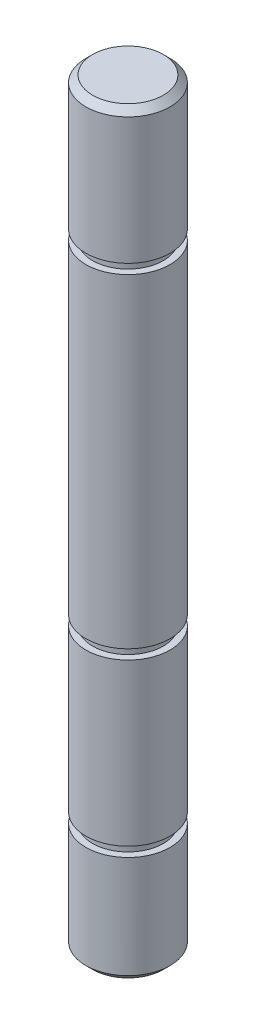
ISO-10303-21;
HEADER;
FILE_DESCRIPTION(('STEP AP214'),'2;1');
FILE_NAME('part.step','',(''),(''),'','','');
FILE_SCHEMA(('AUTOMOTIVE_DESIGN { 1 0 10303 214 1 1 1 1 }'));
ENDSEC;
DATA;
#1=APPLICATION_CONTEXT('core data for automotive mechanical design processes');
#2=APPLICATION_PROTOCOL_DEFINITION('international standard','automotive_design',2000,#1);
#3=PRODUCT_CONTEXT('',#1,'mechanical');
#4=PRODUCT('Part','Part','',(#3));
#5=PRODUCT_RELATED_PRODUCT_CATEGORY('part','',(#4));
#6=PRODUCT_DEFINITION_FORMATION('','',#4);
#7=PRODUCT_DEFINITION_CONTEXT('part definition',#1,'design');
#8=PRODUCT_DEFINITION('design','',#6,#7);
#9=PRODUCT_DEFINITION_SHAPE('','',#8);
#10=(LENGTH_UNIT() NAMED_UNIT(*) SI_UNIT(.MILLI.,.METRE.));
#11=(NAMED_UNIT(*) PLANE_ANGLE_UNIT() SI_UNIT($,.RADIAN.));
#12=(NAMED_UNIT(*) SI_UNIT($,.STERADIAN.) SOLID_ANGLE_UNIT());
#13=UNCERTAINTY_MEASURE_WITH_UNIT(LENGTH_MEASURE(1.E-05),#10,'distance_accuracy_value','');
#14=(GEOMETRIC_REPRESENTATION_CONTEXT(3) GLOBAL_UNCERTAINTY_ASSIGNED_CONTEXT((#13)) GLOBAL_UNIT_ASSIGNED_CONTEXT((#10,
#11,#12)) REPRESENTATION_CONTEXT('',''));
#15=CARTESIAN_POINT('',(0.,0.,0.));
#16=DIRECTION('',(0.,0.,1.));
#17=DIRECTION('',(1.,0.,0.));
#18=AXIS2_PLACEMENT_3D('',#15,#16,#17);
#19=CARTESIAN_POINT('',(0.,57.15,0.));
#20=DIRECTION('',(0.,1.,0.));
#21=DIRECTION('',(0.,0.,1.));
#22=AXIS2_PLACEMENT_3D('',#19,#20,#21);
#23=PLANE('',#22);
#24=CARTESIAN_POINT('',(0.,57.15,0.));
#25=DIRECTION('',(0.,1.,0.));
#26=DIRECTION('',(0.,0.,1.));
#27=AXIS2_PLACEMENT_3D('',#24,#25,#26);
#28=CIRCLE('',#27,2.66699999999999);
#29=CARTESIAN_POINT('',(0.,57.15,2.66699999999999));
#30=VERTEX_POINT('',#29);
#31=EDGE_CURVE('E38',#30,#30,#28,.T.);
#32=ORIENTED_EDGE('',*,*,#31,.T.);
#33=EDGE_LOOP('',(#32));
#34=FACE_BOUND('',#33,.T.);
#35=ADVANCED_FACE('F31',(#34),#23,.T.);
#36=CARTESIAN_POINT('',(0.,0.,0.));
#37=DIRECTION('',(0.,1.,0.));
#38=DIRECTION('',(0.,0.,1.));
#39=AXIS2_PLACEMENT_3D('',#36,#37,#38);
#40=CYLINDRICAL_SURFACE('',#39,3.175);
#41=CARTESIAN_POINT('',(0.,56.642,0.));
#42=DIRECTION('',(0.,1.,0.));
#43=DIRECTION('',(0.,0.,1.));
#44=AXIS2_PLACEMENT_3D('',#41,#42,#43);
#45=CIRCLE('',#44,3.175);
#46=CARTESIAN_POINT('',(0.,56.642,3.175));
#47=VERTEX_POINT('',#46);
#48=EDGE_CURVE('E10',#47,#47,#45,.F.);
#49=ORIENTED_EDGE('',*,*,#48,.T.);
#50=EDGE_LOOP('',(#49));
#51=FACE_BOUND('',#50,.T.);
#52=CARTESIAN_POINT('',(0.,47.0723,0.));
#53=DIRECTION('',(0.,1.,0.));
#54=DIRECTION('',(0.,0.,1.));
#55=AXIS2_PLACEMENT_3D('',#52,#53,#54);
#56=CIRCLE('',#55,3.175);
#57=CARTESIAN_POINT('',(0.,47.0723,3.175));
#58=VERTEX_POINT('',#57);
#59=EDGE_CURVE('E51',#58,#58,#56,.T.);
#60=ORIENTED_EDGE('',*,*,#59,.T.);
#61=EDGE_LOOP('',(#60));
#62=FACE_BOUND('',#61,.T.);
#63=ADVANCED_FACE('F106',(#51,#62),#40,.T.);
#64=CARTESIAN_POINT('',(-3.175,47.0723,0.));
#65=DIRECTION('',(0.,-1.,0.));
#66=DIRECTION('',(0.,0.,-1.));
#67=AXIS2_PLACEMENT_3D('',#64,#65,#66);
#68=PLANE('',#67);
#69=CARTESIAN_POINT('',(0.,47.0723,0.));
#70=DIRECTION('',(0.,1.,0.));
#71=DIRECTION('',(0.,0.,1.));
#72=AXIS2_PLACEMENT_3D('',#69,#70,#71);
#73=CIRCLE('',#72,2.667);
#74=CARTESIAN_POINT('',(0.,47.0723,2.667));
#75=VERTEX_POINT('',#74);
#76=EDGE_CURVE('E54',#75,#75,#73,.T.);
#77=ORIENTED_EDGE('',*,*,#76,.T.);
#78=EDGE_LOOP('',(#77));
#79=FACE_BOUND('',#78,.T.);
#80=ORIENTED_EDGE('',*,*,#59,.F.);
#81=EDGE_LOOP('',(#80));
#82=FACE_BOUND('',#81,.T.);
#83=ADVANCED_FACE('F111',(#79,#82),#68,.T.);
#84=CARTESIAN_POINT('',(0.,0.,0.));
#85=DIRECTION('',(0.,1.,0.));
#86=DIRECTION('',(0.,0.,1.));
#87=AXIS2_PLACEMENT_3D('',#84,#85,#86);
#88=CYLINDRICAL_SURFACE('',#87,2.667);
#89=CARTESIAN_POINT('',(0.,46.3357,0.));
#90=DIRECTION('',(0.,1.,0.));
#91=DIRECTION('',(0.,0.,1.));
#92=AXIS2_PLACEMENT_3D('',#89,#90,#91);
#93=CIRCLE('',#92,2.667);
#94=CARTESIAN_POINT('',(0.,46.3357,2.667));
#95=VERTEX_POINT('',#94);
#96=EDGE_CURVE('E57',#95,#95,#93,.T.);
#97=ORIENTED_EDGE('',*,*,#96,.T.);
#98=EDGE_LOOP('',(#97));
#99=FACE_BOUND('',#98,.T.);
#100=ORIENTED_EDGE('',*,*,#76,.F.);
#101=EDGE_LOOP('',(#100));
#102=FACE_BOUND('',#101,.T.);
#103=ADVANCED_FACE('F237',(#99,#102),#88,.T.);
#104=CARTESIAN_POINT('',(-3.175,46.3357,0.));
#105=DIRECTION('',(0.,1.,0.));
#106=DIRECTION('',(0.,0.,1.));
#107=AXIS2_PLACEMENT_3D('',#104,#105,#106);
#108=PLANE('',#107);
#109=CARTESIAN_POINT('',(0.,46.3357,0.));
#110=DIRECTION('',(0.,1.,0.));
#111=DIRECTION('',(0.,0.,1.));
#112=AXIS2_PLACEMENT_3D('',#109,#110,#111);
#113=CIRCLE('',#112,3.175);
#114=CARTESIAN_POINT('',(0.,46.3357,3.175));
#115=VERTEX_POINT('',#114);
#116=EDGE_CURVE('E60',#115,#115,#113,.T.);
#117=ORIENTED_EDGE('',*,*,#116,.T.);
#118=EDGE_LOOP('',(#117));
#119=FACE_BOUND('',#118,.T.);
#120=ORIENTED_EDGE('',*,*,#96,.F.);
#121=EDGE_LOOP('',(#120));
#122=FACE_BOUND('',#121,.T.);
#123=ADVANCED_FACE('F227',(#119,#122),#108,.T.);
#124=CARTESIAN_POINT('',(0.,0.,0.));
#125=DIRECTION('',(0.,1.,0.));
#126=DIRECTION('',(0.,0.,1.));
#127=AXIS2_PLACEMENT_3D('',#124,#125,#126);
#128=CYLINDRICAL_SURFACE('',#127,3.175);
#129=CARTESIAN_POINT('',(0.,21.8755,0.));
#130=DIRECTION('',(0.,1.,0.));
#131=DIRECTION('',(0.,0.,1.));
#132=AXIS2_PLACEMENT_3D('',#129,#130,#131);
#133=CIRCLE('',#132,3.175);
#134=CARTESIAN_POINT('',(0.,21.8755,3.175));
#135=VERTEX_POINT('',#134);
#136=EDGE_CURVE('E63',#135,#135,#133,.T.);
#137=ORIENTED_EDGE('',*,*,#136,.T.);
#138=EDGE_LOOP('',(#137));
#139=FACE_BOUND('',#138,.T.);
#140=ORIENTED_EDGE('',*,*,#116,.F.);
#141=EDGE_LOOP('',(#140));
#142=FACE_BOUND('',#141,.T.);
#143=ADVANCED_FACE('F217',(#139,#142),#128,.T.);
#144=CARTESIAN_POINT('',(-3.175,21.8755,0.));
#145=DIRECTION('',(0.,-1.,0.));
#146=DIRECTION('',(0.,0.,-1.));
#147=AXIS2_PLACEMENT_3D('',#144,#145,#146);
#148=PLANE('',#147);
#149=CARTESIAN_POINT('',(0.,21.8755,0.));
#150=DIRECTION('',(0.,1.,0.));
#151=DIRECTION('',(0.,0.,1.));
#152=AXIS2_PLACEMENT_3D('',#149,#150,#151);
#153=CIRCLE('',#152,2.667);
#154=CARTESIAN_POINT('',(0.,21.8755,2.667));
#155=VERTEX_POINT('',#154);
#156=EDGE_CURVE('E66',#155,#155,#153,.T.);
#157=ORIENTED_EDGE('',*,*,#156,.T.);
#158=EDGE_LOOP('',(#157));
#159=FACE_BOUND('',#158,.T.);
#160=ORIENTED_EDGE('',*,*,#136,.F.);
#161=EDGE_LOOP('',(#160));
#162=FACE_BOUND('',#161,.T.);
#163=ADVANCED_FACE('F207',(#159,#162),#148,.T.);
#164=CARTESIAN_POINT('',(0.,0.,0.));
#165=DIRECTION('',(0.,1.,0.));
#166=DIRECTION('',(0.,0.,1.));
#167=AXIS2_PLACEMENT_3D('',#164,#165,#166);
#168=CYLINDRICAL_SURFACE('',#167,2.667);
#169=CARTESIAN_POINT('',(0.,21.1389,0.));
#170=DIRECTION('',(0.,1.,0.));
#171=DIRECTION('',(0.,0.,1.));
#172=AXIS2_PLACEMENT_3D('',#169,#170,#171);
#173=CIRCLE('',#172,2.667);
#174=CARTESIAN_POINT('',(0.,21.1389,2.667));
#175=VERTEX_POINT('',#174);
#176=EDGE_CURVE('E69',#175,#175,#173,.T.);
#177=ORIENTED_EDGE('',*,*,#176,.T.);
#178=EDGE_LOOP('',(#177));
#179=FACE_BOUND('',#178,.T.);
#180=ORIENTED_EDGE('',*,*,#156,.F.);
#181=EDGE_LOOP('',(#180));
#182=FACE_BOUND('',#181,.T.);
#183=ADVANCED_FACE('F197',(#179,#182),#168,.T.);
#184=CARTESIAN_POINT('',(-3.175,21.1389,0.));
#185=DIRECTION('',(0.,1.,0.));
#186=DIRECTION('',(0.,0.,1.));
#187=AXIS2_PLACEMENT_3D('',#184,#185,#186);
#188=PLANE('',#187);
#189=CARTESIAN_POINT('',(0.,21.1389,0.));
#190=DIRECTION('',(0.,1.,0.));
#191=DIRECTION('',(0.,0.,1.));
#192=AXIS2_PLACEMENT_3D('',#189,#190,#191);
#193=CIRCLE('',#192,3.175);
#194=CARTESIAN_POINT('',(0.,21.1389,3.175));
#195=VERTEX_POINT('',#194);
#196=EDGE_CURVE('E72',#195,#195,#193,.T.);
#197=ORIENTED_EDGE('',*,*,#196,.T.);
#198=EDGE_LOOP('',(#197));
#199=FACE_BOUND('',#198,.T.);
#200=ORIENTED_EDGE('',*,*,#176,.F.);
#201=EDGE_LOOP('',(#200));
#202=FACE_BOUND('',#201,.T.);
#203=ADVANCED_FACE('F187',(#199,#202),#188,.T.);
#204=CARTESIAN_POINT('',(0.,0.,0.));
#205=DIRECTION('',(0.,1.,0.));
#206=DIRECTION('',(0.,0.,1.));
#207=AXIS2_PLACEMENT_3D('',#204,#205,#206);
#208=CYLINDRICAL_SURFACE('',#207,3.175);
#209=CARTESIAN_POINT('',(0.,8.9723,0.));
#210=DIRECTION('',(0.,1.,0.));
#211=DIRECTION('',(0.,0.,1.));
#212=AXIS2_PLACEMENT_3D('',#209,#210,#211);
#213=CIRCLE('',#212,3.175);
#214=CARTESIAN_POINT('',(0.,8.9723,3.175));
#215=VERTEX_POINT('',#214);
#216=EDGE_CURVE('E75',#215,#215,#213,.T.);
#217=ORIENTED_EDGE('',*,*,#216,.T.);
#218=EDGE_LOOP('',(#217));
#219=FACE_BOUND('',#218,.T.);
#220=ORIENTED_EDGE('',*,*,#196,.F.);
#221=EDGE_LOOP('',(#220));
#222=FACE_BOUND('',#221,.T.);
#223=ADVANCED_FACE('F177',(#219,#222),#208,.T.);
#224=CARTESIAN_POINT('',(-3.175,8.9723,0.));
#225=DIRECTION('',(0.,-1.,0.));
#226=DIRECTION('',(0.,0.,-1.));
#227=AXIS2_PLACEMENT_3D('',#224,#225,#226);
#228=PLANE('',#227);
#229=CARTESIAN_POINT('',(0.,8.9723,0.));
#230=DIRECTION('',(0.,1.,0.));
#231=DIRECTION('',(0.,0.,1.));
#232=AXIS2_PLACEMENT_3D('',#229,#230,#231);
#233=CIRCLE('',#232,2.667);
#234=CARTESIAN_POINT('',(0.,8.9723,2.667));
#235=VERTEX_POINT('',#234);
#236=EDGE_CURVE('E78',#235,#235,#233,.T.);
#237=ORIENTED_EDGE('',*,*,#236,.T.);
#238=EDGE_LOOP('',(#237));
#239=FACE_BOUND('',#238,.T.);
#240=ORIENTED_EDGE('',*,*,#216,.F.);
#241=EDGE_LOOP('',(#240));
#242=FACE_BOUND('',#241,.T.);
#243=ADVANCED_FACE('F167',(#239,#242),#228,.T.);
#244=CARTESIAN_POINT('',(0.,0.,0.));
#245=DIRECTION('',(0.,1.,0.));
#246=DIRECTION('',(0.,0.,1.));
#247=AXIS2_PLACEMENT_3D('',#244,#245,#246);
#248=CYLINDRICAL_SURFACE('',#247,2.667);
#249=CARTESIAN_POINT('',(0.,8.2357,0.));
#250=DIRECTION('',(0.,1.,0.));
#251=DIRECTION('',(0.,0.,1.));
#252=AXIS2_PLACEMENT_3D('',#249,#250,#251);
#253=CIRCLE('',#252,2.667);
#254=CARTESIAN_POINT('',(0.,8.2357,2.667));
#255=VERTEX_POINT('',#254);
#256=EDGE_CURVE('E81',#255,#255,#253,.T.);
#257=ORIENTED_EDGE('',*,*,#256,.T.);
#258=EDGE_LOOP('',(#257));
#259=FACE_BOUND('',#258,.T.);
#260=ORIENTED_EDGE('',*,*,#236,.F.);
#261=EDGE_LOOP('',(#260));
#262=FACE_BOUND('',#261,.T.);
#263=ADVANCED_FACE('F103',(#259,#262),#248,.T.);
#264=CARTESIAN_POINT('',(-3.175,8.2357,0.));
#265=DIRECTION('',(0.,1.,0.));
#266=DIRECTION('',(0.,0.,1.));
#267=AXIS2_PLACEMENT_3D('',#264,#265,#266);
#268=PLANE('',#267);
#269=CARTESIAN_POINT('',(0.,8.2357,0.));
#270=DIRECTION('',(0.,1.,0.));
#271=DIRECTION('',(0.,0.,1.));
#272=AXIS2_PLACEMENT_3D('',#269,#270,#271);
#273=CIRCLE('',#272,3.175);
#274=CARTESIAN_POINT('',(0.,8.2357,3.175));
#275=VERTEX_POINT('',#274);
#276=EDGE_CURVE('E84',#275,#275,#273,.T.);
#277=ORIENTED_EDGE('',*,*,#276,.T.);
#278=EDGE_LOOP('',(#277));
#279=FACE_BOUND('',#278,.T.);
#280=ORIENTED_EDGE('',*,*,#256,.F.);
#281=EDGE_LOOP('',(#280));
#282=FACE_BOUND('',#281,.T.);
#283=ADVANCED_FACE('F88',(#279,#282),#268,.T.);
#284=CARTESIAN_POINT('',(0.,0.,0.));
#285=DIRECTION('',(0.,1.,0.));
#286=DIRECTION('',(0.,0.,1.));
#287=AXIS2_PLACEMENT_3D('',#284,#285,#286);
#288=CYLINDRICAL_SURFACE('',#287,3.175);
#289=CARTESIAN_POINT('',(0.,0.508,0.));
#290=DIRECTION('',(0.,-1.,0.));
#291=DIRECTION('',(0.,0.,-1.));
#292=AXIS2_PLACEMENT_3D('',#289,#290,#291);
#293=CIRCLE('',#292,3.175);
#294=CARTESIAN_POINT('',(0.,0.508,-3.175));
#295=VERTEX_POINT('',#294);
#296=EDGE_CURVE('E46',#295,#295,#293,.F.);
#297=ORIENTED_EDGE('',*,*,#296,.T.);
#298=EDGE_LOOP('',(#297));
#299=FACE_BOUND('',#298,.T.);
#300=ORIENTED_EDGE('',*,*,#276,.F.);
#301=EDGE_LOOP('',(#300));
#302=FACE_BOUND('',#301,.T.);
#303=ADVANCED_FACE('F91',(#299,#302),#288,.T.);
#304=CARTESIAN_POINT('',(0.,0.,0.));
#305=DIRECTION('',(0.,-1.,0.));
#306=DIRECTION('',(0.,0.,-1.));
#307=AXIS2_PLACEMENT_3D('',#304,#305,#306);
#308=PLANE('',#307);
#309=CARTESIAN_POINT('',(0.,0.,0.));
#310=DIRECTION('',(0.,-1.,0.));
#311=DIRECTION('',(0.,0.,-1.));
#312=AXIS2_PLACEMENT_3D('',#309,#310,#311);
#313=CIRCLE('',#312,2.667);
#314=CARTESIAN_POINT('',(0.,0.,-2.667));
#315=VERTEX_POINT('',#314);
#316=EDGE_CURVE('E42',#315,#315,#313,.T.);
#317=ORIENTED_EDGE('',*,*,#316,.T.);
#318=EDGE_LOOP('',(#317));
#319=FACE_BOUND('',#318,.T.);
#320=ADVANCED_FACE('F93',(#319),#308,.T.);
#321=CARTESIAN_POINT('',(0.,0.508,0.));
#322=DIRECTION('',(0.,1.,0.));
#323=DIRECTION('',(0.,0.,1.));
#324=AXIS2_PLACEMENT_3D('',#321,#322,#323);
#325=CONICAL_SURFACE('',#324,3.175,0.785398163397445);
#326=ORIENTED_EDGE('',*,*,#316,.F.);
#327=EDGE_LOOP('',(#326));
#328=FACE_BOUND('',#327,.T.);
#329=ORIENTED_EDGE('',*,*,#296,.F.);
#330=EDGE_LOOP('',(#329));
#331=FACE_BOUND('',#330,.T.);
#332=ADVANCED_FACE('F100',(#328,#331),#325,.T.);
#333=CARTESIAN_POINT('',(0.,57.15,0.));
#334=DIRECTION('',(0.,-1.,0.));
#335=DIRECTION('',(0.,0.,-1.));
#336=AXIS2_PLACEMENT_3D('',#333,#334,#335);
#337=CONICAL_SURFACE('',#336,2.66699999999999,0.785398163397451);
#338=ORIENTED_EDGE('',*,*,#48,.F.);
#339=EDGE_LOOP('',(#338));
#340=FACE_BOUND('',#339,.T.);
#341=ORIENTED_EDGE('',*,*,#31,.F.);
#342=EDGE_LOOP('',(#341));
#343=FACE_BOUND('',#342,.T.);
#344=ADVANCED_FACE('F33',(#340,#343),#337,.T.);
#345=CLOSED_SHELL('',(#35,#63,#83,#103,#123,#143,#163,#183,#203,#223,#243,#263,#283,#303,#320,
#332,#344));
#346=MANIFOLD_SOLID_BREP('B2',#345);
#347=ADVANCED_BREP_SHAPE_REPRESENTATION('',(#18,#346),#14);
#348=SHAPE_DEFINITION_REPRESENTATION(#9,#347);
ENDSEC;
END-ISO-10303-21;
